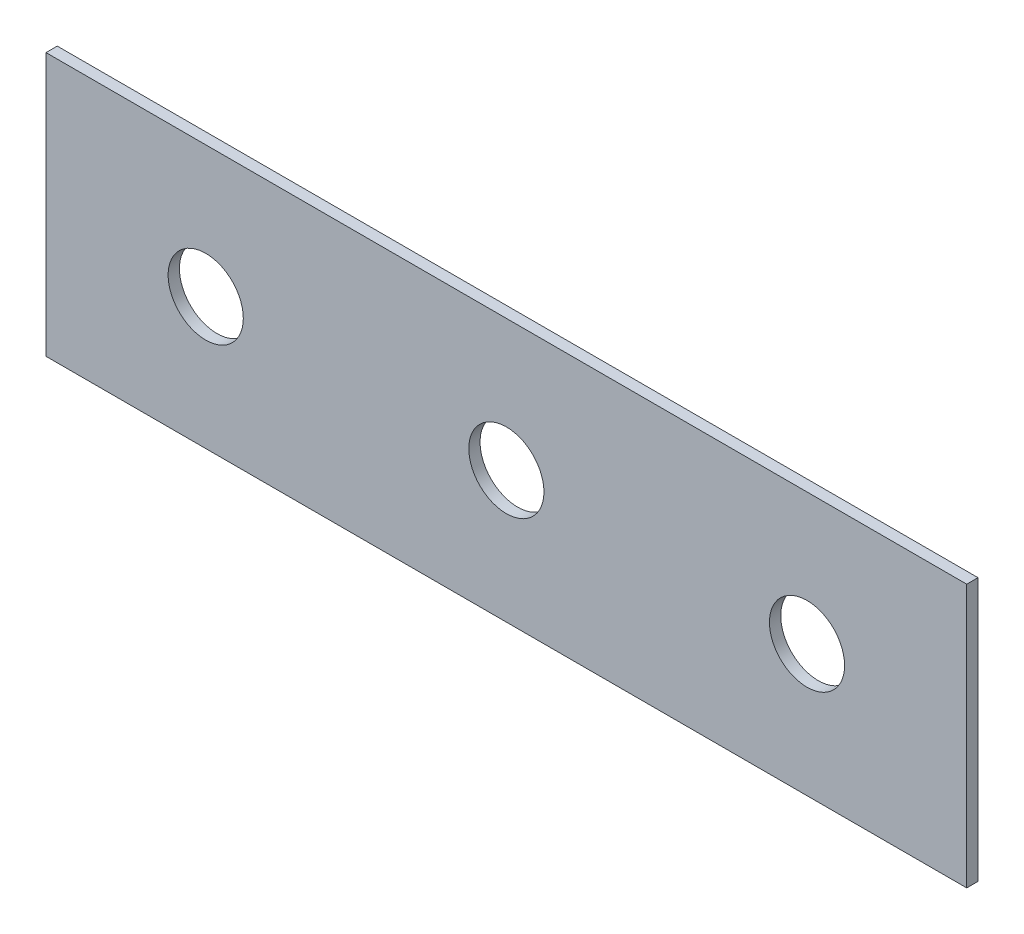
ISO-10303-21;
HEADER;
FILE_DESCRIPTION(('STEP AP214'),'2;1');
FILE_NAME('part.step','',(''),(''),'','','');
FILE_SCHEMA(('AUTOMOTIVE_DESIGN { 1 0 10303 214 1 1 1 1 }'));
ENDSEC;
DATA;
#1=APPLICATION_CONTEXT('core data for automotive mechanical design processes');
#2=APPLICATION_PROTOCOL_DEFINITION('international standard','automotive_design',2000,#1);
#3=PRODUCT_CONTEXT('',#1,'mechanical');
#4=PRODUCT('Part','Part','',(#3));
#5=PRODUCT_RELATED_PRODUCT_CATEGORY('part','',(#4));
#6=PRODUCT_DEFINITION_FORMATION('','',#4);
#7=PRODUCT_DEFINITION_CONTEXT('part definition',#1,'design');
#8=PRODUCT_DEFINITION('design','',#6,#7);
#9=PRODUCT_DEFINITION_SHAPE('','',#8);
#10=(LENGTH_UNIT() NAMED_UNIT(*) SI_UNIT(.MILLI.,.METRE.));
#11=(NAMED_UNIT(*) PLANE_ANGLE_UNIT() SI_UNIT($,.RADIAN.));
#12=(NAMED_UNIT(*) SI_UNIT($,.STERADIAN.) SOLID_ANGLE_UNIT());
#13=UNCERTAINTY_MEASURE_WITH_UNIT(LENGTH_MEASURE(1.E-05),#10,'distance_accuracy_value','');
#14=(GEOMETRIC_REPRESENTATION_CONTEXT(3) GLOBAL_UNCERTAINTY_ASSIGNED_CONTEXT((#13)) GLOBAL_UNIT_ASSIGNED_CONTEXT((#10,
#11,#12)) REPRESENTATION_CONTEXT('',''));
#15=CARTESIAN_POINT('',(0.,0.,0.));
#16=DIRECTION('',(0.,0.,1.));
#17=DIRECTION('',(1.,0.,0.));
#18=AXIS2_PLACEMENT_3D('',#15,#16,#17);
#19=CARTESIAN_POINT('',(122.5,35.,3.));
#20=DIRECTION('',(-1.,0.,0.));
#21=DIRECTION('',(0.,-1.,0.));
#22=AXIS2_PLACEMENT_3D('',#19,#20,#21);
#23=PLANE('',#22);
#24=DIRECTION('',(0.,1.,0.));
#25=VECTOR('',#24,1.);
#26=CARTESIAN_POINT('',(122.5,35.,0.));
#27=LINE('',#26,#25);
#28=CARTESIAN_POINT('',(122.5,-35.,0.));
#29=VERTEX_POINT('',#28);
#30=CARTESIAN_POINT('',(122.5,35.,0.));
#31=VERTEX_POINT('',#30);
#32=EDGE_CURVE('E107',#29,#31,#27,.T.);
#33=ORIENTED_EDGE('',*,*,#32,.T.);
#34=DIRECTION('',(0.,0.,-1.));
#35=VECTOR('',#34,1.);
#36=CARTESIAN_POINT('',(122.5,35.,3.));
#37=LINE('',#36,#35);
#38=CARTESIAN_POINT('',(122.5,35.,3.));
#39=VERTEX_POINT('',#38);
#40=EDGE_CURVE('E11',#39,#31,#37,.T.);
#41=ORIENTED_EDGE('',*,*,#40,.F.);
#42=DIRECTION('',(0.,1.,0.));
#43=VECTOR('',#42,1.);
#44=CARTESIAN_POINT('',(122.5,35.,3.));
#45=LINE('',#44,#43);
#46=CARTESIAN_POINT('',(122.5,-35.,3.));
#47=VERTEX_POINT('',#46);
#48=EDGE_CURVE('E91',#47,#39,#45,.T.);
#49=ORIENTED_EDGE('',*,*,#48,.F.);
#50=DIRECTION('',(0.,0.,-1.));
#51=VECTOR('',#50,1.);
#52=CARTESIAN_POINT('',(122.5,-35.,3.));
#53=LINE('',#52,#51);
#54=EDGE_CURVE('E103',#47,#29,#53,.T.);
#55=ORIENTED_EDGE('',*,*,#54,.T.);
#56=EDGE_LOOP('',(#33,#41,#49,#55));
#57=FACE_BOUND('',#56,.T.);
#58=ADVANCED_FACE('F39',(#57),#23,.F.);
#59=CARTESIAN_POINT('',(-122.5,35.,3.));
#60=DIRECTION('',(0.,-1.,0.));
#61=DIRECTION('',(0.,0.,-1.));
#62=AXIS2_PLACEMENT_3D('',#59,#60,#61);
#63=PLANE('',#62);
#64=DIRECTION('',(-1.,0.,0.));
#65=VECTOR('',#64,1.);
#66=CARTESIAN_POINT('',(-122.5,35.,0.));
#67=LINE('',#66,#65);
#68=CARTESIAN_POINT('',(-122.5,35.,0.));
#69=VERTEX_POINT('',#68);
#70=EDGE_CURVE('E96',#31,#69,#67,.T.);
#71=ORIENTED_EDGE('',*,*,#70,.T.);
#72=DIRECTION('',(0.,0.,-1.));
#73=VECTOR('',#72,1.);
#74=CARTESIAN_POINT('',(-122.5,35.,3.));
#75=LINE('',#74,#73);
#76=CARTESIAN_POINT('',(-122.5,35.,3.));
#77=VERTEX_POINT('',#76);
#78=EDGE_CURVE('E48',#77,#69,#75,.T.);
#79=ORIENTED_EDGE('',*,*,#78,.F.);
#80=DIRECTION('',(-1.,0.,0.));
#81=VECTOR('',#80,1.);
#82=CARTESIAN_POINT('',(-122.5,35.,3.));
#83=LINE('',#82,#81);
#84=EDGE_CURVE('E86',#39,#77,#83,.T.);
#85=ORIENTED_EDGE('',*,*,#84,.F.);
#86=ORIENTED_EDGE('',*,*,#40,.T.);
#87=EDGE_LOOP('',(#71,#79,#85,#86));
#88=FACE_BOUND('',#87,.T.);
#89=ADVANCED_FACE('F95',(#88),#63,.F.);
#90=CARTESIAN_POINT('',(-122.5,35.,3.));
#91=DIRECTION('',(1.,0.,0.));
#92=DIRECTION('',(0.,1.,0.));
#93=AXIS2_PLACEMENT_3D('',#90,#91,#92);
#94=PLANE('',#93);
#95=DIRECTION('',(0.,-1.,0.));
#96=VECTOR('',#95,1.);
#97=CARTESIAN_POINT('',(-122.5,35.,0.));
#98=LINE('',#97,#96);
#99=CARTESIAN_POINT('',(-122.5,-35.,0.));
#100=VERTEX_POINT('',#99);
#101=EDGE_CURVE('E73',#69,#100,#98,.T.);
#102=ORIENTED_EDGE('',*,*,#101,.T.);
#103=DIRECTION('',(0.,0.,-1.));
#104=VECTOR('',#103,1.);
#105=CARTESIAN_POINT('',(-122.5,-35.,3.));
#106=LINE('',#105,#104);
#107=CARTESIAN_POINT('',(-122.5,-35.,3.));
#108=VERTEX_POINT('',#107);
#109=EDGE_CURVE('E98',#108,#100,#106,.T.);
#110=ORIENTED_EDGE('',*,*,#109,.F.);
#111=DIRECTION('',(0.,-1.,0.));
#112=VECTOR('',#111,1.);
#113=CARTESIAN_POINT('',(-122.5,35.,3.));
#114=LINE('',#113,#112);
#115=EDGE_CURVE('E89',#77,#108,#114,.T.);
#116=ORIENTED_EDGE('',*,*,#115,.F.);
#117=ORIENTED_EDGE('',*,*,#78,.T.);
#118=EDGE_LOOP('',(#102,#110,#116,#117));
#119=FACE_BOUND('',#118,.T.);
#120=ADVANCED_FACE('F99',(#119),#94,.F.);
#121=CARTESIAN_POINT('',(-122.5,-35.,3.));
#122=DIRECTION('',(0.,1.,0.));
#123=DIRECTION('',(0.,0.,1.));
#124=AXIS2_PLACEMENT_3D('',#121,#122,#123);
#125=PLANE('',#124);
#126=DIRECTION('',(1.,0.,0.));
#127=VECTOR('',#126,1.);
#128=CARTESIAN_POINT('',(-122.5,-35.,0.));
#129=LINE('',#128,#127);
#130=EDGE_CURVE('E79',#100,#29,#129,.T.);
#131=ORIENTED_EDGE('',*,*,#130,.T.);
#132=ORIENTED_EDGE('',*,*,#54,.F.);
#133=DIRECTION('',(1.,0.,0.));
#134=VECTOR('',#133,1.);
#135=CARTESIAN_POINT('',(-122.5,-35.,3.));
#136=LINE('',#135,#134);
#137=EDGE_CURVE('E56',#108,#47,#136,.T.);
#138=ORIENTED_EDGE('',*,*,#137,.F.);
#139=ORIENTED_EDGE('',*,*,#109,.T.);
#140=EDGE_LOOP('',(#131,#132,#138,#139));
#141=FACE_BOUND('',#140,.T.);
#142=ADVANCED_FACE('F121',(#141),#125,.F.);
#143=CARTESIAN_POINT('',(0.,0.,3.));
#144=DIRECTION('',(0.,0.,1.));
#145=DIRECTION('',(1.,0.,0.));
#146=AXIS2_PLACEMENT_3D('',#143,#144,#145);
#147=PLANE('',#146);
#148=CARTESIAN_POINT('',(-80.,0.,3.));
#149=DIRECTION('',(0.,0.,1.));
#150=DIRECTION('',(1.,0.,0.));
#151=AXIS2_PLACEMENT_3D('',#148,#149,#150);
#152=CIRCLE('',#151,9.99999999999999);
#153=CARTESIAN_POINT('',(-70.,0.,3.));
#154=VERTEX_POINT('',#153);
#155=EDGE_CURVE('E144',#154,#154,#152,.T.);
#156=ORIENTED_EDGE('',*,*,#155,.F.);
#157=EDGE_LOOP('',(#156));
#158=FACE_BOUND('',#157,.T.);
#159=CARTESIAN_POINT('',(0.,0.,3.));
#160=DIRECTION('',(0.,0.,1.));
#161=DIRECTION('',(1.,0.,0.));
#162=AXIS2_PLACEMENT_3D('',#159,#160,#161);
#163=CIRCLE('',#162,10.);
#164=CARTESIAN_POINT('',(10.,0.,3.));
#165=VERTEX_POINT('',#164);
#166=EDGE_CURVE('E136',#165,#165,#163,.T.);
#167=ORIENTED_EDGE('',*,*,#166,.F.);
#168=EDGE_LOOP('',(#167));
#169=FACE_BOUND('',#168,.T.);
#170=CARTESIAN_POINT('',(80.,0.,3.));
#171=DIRECTION('',(0.,0.,1.));
#172=DIRECTION('',(1.,0.,0.));
#173=AXIS2_PLACEMENT_3D('',#170,#171,#172);
#174=CIRCLE('',#173,9.99999999999999);
#175=CARTESIAN_POINT('',(90.,0.,3.));
#176=VERTEX_POINT('',#175);
#177=EDGE_CURVE('E128',#176,#176,#174,.T.);
#178=ORIENTED_EDGE('',*,*,#177,.F.);
#179=EDGE_LOOP('',(#178));
#180=FACE_BOUND('',#179,.T.);
#181=ORIENTED_EDGE('',*,*,#48,.T.);
#182=ORIENTED_EDGE('',*,*,#84,.T.);
#183=ORIENTED_EDGE('',*,*,#115,.T.);
#184=ORIENTED_EDGE('',*,*,#137,.T.);
#185=EDGE_LOOP('',(#181,#182,#183,#184));
#186=FACE_BOUND('',#185,.T.);
#187=ADVANCED_FACE('F87',(#158,#169,#180,#186),#147,.T.);
#188=CARTESIAN_POINT('',(0.,0.,0.));
#189=DIRECTION('',(0.,0.,1.));
#190=DIRECTION('',(1.,0.,0.));
#191=AXIS2_PLACEMENT_3D('',#188,#189,#190);
#192=PLANE('',#191);
#193=CARTESIAN_POINT('',(-80.,0.,0.));
#194=DIRECTION('',(0.,0.,1.));
#195=DIRECTION('',(1.,0.,0.));
#196=AXIS2_PLACEMENT_3D('',#193,#194,#195);
#197=CIRCLE('',#196,9.99999999999999);
#198=CARTESIAN_POINT('',(-70.,0.,0.));
#199=VERTEX_POINT('',#198);
#200=EDGE_CURVE('E111',#199,#199,#197,.T.);
#201=ORIENTED_EDGE('',*,*,#200,.T.);
#202=EDGE_LOOP('',(#201));
#203=FACE_BOUND('',#202,.T.);
#204=CARTESIAN_POINT('',(0.,0.,0.));
#205=DIRECTION('',(0.,0.,1.));
#206=DIRECTION('',(1.,0.,0.));
#207=AXIS2_PLACEMENT_3D('',#204,#205,#206);
#208=CIRCLE('',#207,10.);
#209=CARTESIAN_POINT('',(10.,0.,0.));
#210=VERTEX_POINT('',#209);
#211=EDGE_CURVE('E140',#210,#210,#208,.T.);
#212=ORIENTED_EDGE('',*,*,#211,.T.);
#213=EDGE_LOOP('',(#212));
#214=FACE_BOUND('',#213,.T.);
#215=CARTESIAN_POINT('',(80.,0.,0.));
#216=DIRECTION('',(0.,0.,1.));
#217=DIRECTION('',(1.,0.,0.));
#218=AXIS2_PLACEMENT_3D('',#215,#216,#217);
#219=CIRCLE('',#218,9.99999999999999);
#220=CARTESIAN_POINT('',(90.,0.,0.));
#221=VERTEX_POINT('',#220);
#222=EDGE_CURVE('E132',#221,#221,#219,.T.);
#223=ORIENTED_EDGE('',*,*,#222,.T.);
#224=EDGE_LOOP('',(#223));
#225=FACE_BOUND('',#224,.T.);
#226=ORIENTED_EDGE('',*,*,#32,.F.);
#227=ORIENTED_EDGE('',*,*,#130,.F.);
#228=ORIENTED_EDGE('',*,*,#101,.F.);
#229=ORIENTED_EDGE('',*,*,#70,.F.);
#230=EDGE_LOOP('',(#226,#227,#228,#229));
#231=FACE_BOUND('',#230,.T.);
#232=ADVANCED_FACE('F124',(#203,#214,#225,#231),#192,.F.);
#233=CARTESIAN_POINT('',(80.,0.,0.));
#234=DIRECTION('',(0.,0.,1.));
#235=DIRECTION('',(1.,0.,0.));
#236=AXIS2_PLACEMENT_3D('',#233,#234,#235);
#237=CYLINDRICAL_SURFACE('',#236,9.99999999999999);
#238=ORIENTED_EDGE('',*,*,#222,.F.);
#239=EDGE_LOOP('',(#238));
#240=FACE_BOUND('',#239,.T.);
#241=ORIENTED_EDGE('',*,*,#177,.T.);
#242=EDGE_LOOP('',(#241));
#243=FACE_BOUND('',#242,.T.);
#244=ADVANCED_FACE('F168',(#240,#243),#237,.F.);
#245=CARTESIAN_POINT('',(0.,0.,0.));
#246=DIRECTION('',(0.,0.,1.));
#247=DIRECTION('',(1.,0.,0.));
#248=AXIS2_PLACEMENT_3D('',#245,#246,#247);
#249=CYLINDRICAL_SURFACE('',#248,10.);
#250=ORIENTED_EDGE('',*,*,#211,.F.);
#251=EDGE_LOOP('',(#250));
#252=FACE_BOUND('',#251,.T.);
#253=ORIENTED_EDGE('',*,*,#166,.T.);
#254=EDGE_LOOP('',(#253));
#255=FACE_BOUND('',#254,.T.);
#256=ADVANCED_FACE('F157',(#252,#255),#249,.F.);
#257=CARTESIAN_POINT('',(-80.,0.,0.));
#258=DIRECTION('',(0.,0.,1.));
#259=DIRECTION('',(1.,0.,0.));
#260=AXIS2_PLACEMENT_3D('',#257,#258,#259);
#261=CYLINDRICAL_SURFACE('',#260,9.99999999999999);
#262=ORIENTED_EDGE('',*,*,#200,.F.);
#263=EDGE_LOOP('',(#262));
#264=FACE_BOUND('',#263,.T.);
#265=ORIENTED_EDGE('',*,*,#155,.T.);
#266=EDGE_LOOP('',(#265));
#267=FACE_BOUND('',#266,.T.);
#268=ADVANCED_FACE('F154',(#264,#267),#261,.F.);
#269=CLOSED_SHELL('',(#58,#89,#120,#142,#187,#232,#244,#256,#268));
#270=MANIFOLD_SOLID_BREP('B2',#269);
#271=ADVANCED_BREP_SHAPE_REPRESENTATION('',(#18,#270),#14);
#272=SHAPE_DEFINITION_REPRESENTATION(#9,#271);
ENDSEC;
END-ISO-10303-21;
